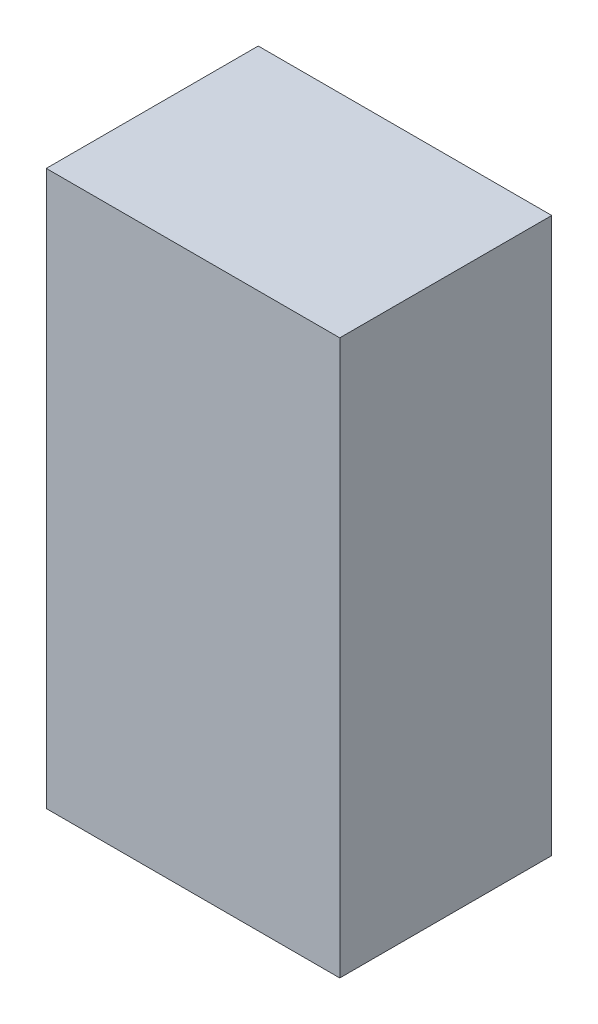
ISO-10303-21;
HEADER;
FILE_DESCRIPTION(('STEP AP214'),'2;1');
FILE_NAME('part.step','',(''),(''),'','','');
FILE_SCHEMA(('AUTOMOTIVE_DESIGN { 1 0 10303 214 1 1 1 1 }'));
ENDSEC;
DATA;
#1=APPLICATION_CONTEXT('core data for automotive mechanical design processes');
#2=APPLICATION_PROTOCOL_DEFINITION('international standard','automotive_design',2000,#1);
#3=PRODUCT_CONTEXT('',#1,'mechanical');
#4=PRODUCT('Part','Part','',(#3));
#5=PRODUCT_RELATED_PRODUCT_CATEGORY('part','',(#4));
#6=PRODUCT_DEFINITION_FORMATION('','',#4);
#7=PRODUCT_DEFINITION_CONTEXT('part definition',#1,'design');
#8=PRODUCT_DEFINITION('design','',#6,#7);
#9=PRODUCT_DEFINITION_SHAPE('','',#8);
#10=(LENGTH_UNIT() NAMED_UNIT(*) SI_UNIT(.MILLI.,.METRE.));
#11=(NAMED_UNIT(*) PLANE_ANGLE_UNIT() SI_UNIT($,.RADIAN.));
#12=(NAMED_UNIT(*) SI_UNIT($,.STERADIAN.) SOLID_ANGLE_UNIT());
#13=UNCERTAINTY_MEASURE_WITH_UNIT(LENGTH_MEASURE(1.E-05),#10,'distance_accuracy_value','');
#14=(GEOMETRIC_REPRESENTATION_CONTEXT(3) GLOBAL_UNCERTAINTY_ASSIGNED_CONTEXT((#13)) GLOBAL_UNIT_ASSIGNED_CONTEXT((#10,
#11,#12)) REPRESENTATION_CONTEXT('',''));
#15=CARTESIAN_POINT('',(0.,0.,0.));
#16=DIRECTION('',(0.,0.,1.));
#17=DIRECTION('',(1.,0.,0.));
#18=AXIS2_PLACEMENT_3D('',#15,#16,#17);
#19=CARTESIAN_POINT('',(-0.90000074,1.69999914,1.29999994));
#20=DIRECTION('',(0.,0.,-1.));
#21=DIRECTION('',(-1.,0.,0.));
#22=AXIS2_PLACEMENT_3D('',#19,#20,#21);
#23=PLANE('',#22);
#24=DIRECTION('',(1.,0.,0.));
#25=VECTOR('',#24,1.);
#26=CARTESIAN_POINT('',(-0.90000074,-1.69999914,1.29999994));
#27=LINE('',#26,#25);
#28=CARTESIAN_POINT('',(-0.90000074,-1.69999914,1.29999994));
#29=VERTEX_POINT('',#28);
#30=CARTESIAN_POINT('',(0.90000074,-1.69999914,1.29999994));
#31=VERTEX_POINT('',#30);
#32=EDGE_CURVE('E54',#29,#31,#27,.T.);
#33=ORIENTED_EDGE('',*,*,#32,.T.);
#34=DIRECTION('',(0.,1.,0.));
#35=VECTOR('',#34,1.);
#36=CARTESIAN_POINT('',(0.90000074,-1.69999914,1.29999994));
#37=LINE('',#36,#35);
#38=CARTESIAN_POINT('',(0.90000074,1.69999914,1.29999994));
#39=VERTEX_POINT('',#38);
#40=EDGE_CURVE('E56',#31,#39,#37,.T.);
#41=ORIENTED_EDGE('',*,*,#40,.T.);
#42=DIRECTION('',(1.,0.,0.));
#43=VECTOR('',#42,1.);
#44=CARTESIAN_POINT('',(0.90000074,1.69999914,1.29999994));
#45=LINE('',#44,#43);
#46=CARTESIAN_POINT('',(-0.90000074,1.69999914,1.29999994));
#47=VERTEX_POINT('',#46);
#48=EDGE_CURVE('E19',#39,#47,#45,.F.);
#49=ORIENTED_EDGE('',*,*,#48,.T.);
#50=DIRECTION('',(0.,1.,0.));
#51=VECTOR('',#50,1.);
#52=CARTESIAN_POINT('',(-0.90000074,1.69999914,1.29999994));
#53=LINE('',#52,#51);
#54=EDGE_CURVE('E79',#47,#29,#53,.F.);
#55=ORIENTED_EDGE('',*,*,#54,.T.);
#56=EDGE_LOOP('',(#33,#41,#49,#55));
#57=FACE_BOUND('',#56,.T.);
#58=ADVANCED_FACE('F16',(#57),#23,.F.);
#59=CARTESIAN_POINT('',(0.90000074,1.69999914,0.));
#60=DIRECTION('',(0.,-1.,0.));
#61=DIRECTION('',(0.,0.,-1.));
#62=AXIS2_PLACEMENT_3D('',#59,#60,#61);
#63=PLANE('',#62);
#64=DIRECTION('',(0.,0.,-1.));
#65=VECTOR('',#64,1.);
#66=CARTESIAN_POINT('',(-0.90000074,1.69999914,0.));
#67=LINE('',#66,#65);
#68=CARTESIAN_POINT('',(-0.90000074,1.69999914,0.));
#69=VERTEX_POINT('',#68);
#70=EDGE_CURVE('E67',#69,#47,#67,.F.);
#71=ORIENTED_EDGE('',*,*,#70,.T.);
#72=ORIENTED_EDGE('',*,*,#48,.F.);
#73=DIRECTION('',(0.,0.,1.));
#74=VECTOR('',#73,1.);
#75=CARTESIAN_POINT('',(0.90000074,1.69999914,0.));
#76=LINE('',#75,#74);
#77=CARTESIAN_POINT('',(0.90000074,1.69999914,0.));
#78=VERTEX_POINT('',#77);
#79=EDGE_CURVE('E62',#39,#78,#76,.F.);
#80=ORIENTED_EDGE('',*,*,#79,.T.);
#81=DIRECTION('',(-1.,0.,0.));
#82=VECTOR('',#81,1.);
#83=CARTESIAN_POINT('',(-0.90000074,1.69999914,0.));
#84=LINE('',#83,#82);
#85=EDGE_CURVE('E82',#69,#78,#84,.F.);
#86=ORIENTED_EDGE('',*,*,#85,.F.);
#87=EDGE_LOOP('',(#71,#72,#80,#86));
#88=FACE_BOUND('',#87,.T.);
#89=ADVANCED_FACE('F64',(#88),#63,.F.);
#90=CARTESIAN_POINT('',(0.90000074,-1.69999914,0.));
#91=DIRECTION('',(-1.,0.,0.));
#92=DIRECTION('',(0.,0.,1.));
#93=AXIS2_PLACEMENT_3D('',#90,#91,#92);
#94=PLANE('',#93);
#95=ORIENTED_EDGE('',*,*,#79,.F.);
#96=ORIENTED_EDGE('',*,*,#40,.F.);
#97=DIRECTION('',(0.,0.,1.));
#98=VECTOR('',#97,1.);
#99=CARTESIAN_POINT('',(0.90000074,-1.69999914,0.));
#100=LINE('',#99,#98);
#101=CARTESIAN_POINT('',(0.90000074,-1.69999914,0.));
#102=VERTEX_POINT('',#101);
#103=EDGE_CURVE('E74',#31,#102,#100,.F.);
#104=ORIENTED_EDGE('',*,*,#103,.T.);
#105=DIRECTION('',(0.,1.,0.));
#106=VECTOR('',#105,1.);
#107=CARTESIAN_POINT('',(0.90000074,1.69999914,0.));
#108=LINE('',#107,#106);
#109=EDGE_CURVE('E71',#78,#102,#108,.F.);
#110=ORIENTED_EDGE('',*,*,#109,.F.);
#111=EDGE_LOOP('',(#95,#96,#104,#110));
#112=FACE_BOUND('',#111,.T.);
#113=ADVANCED_FACE('F69',(#112),#94,.F.);
#114=CARTESIAN_POINT('',(-0.90000074,-1.69999914,0.));
#115=DIRECTION('',(0.,1.,0.));
#116=DIRECTION('',(0.,0.,1.));
#117=AXIS2_PLACEMENT_3D('',#114,#115,#116);
#118=PLANE('',#117);
#119=ORIENTED_EDGE('',*,*,#103,.F.);
#120=ORIENTED_EDGE('',*,*,#32,.F.);
#121=DIRECTION('',(0.,0.,-1.));
#122=VECTOR('',#121,1.);
#123=CARTESIAN_POINT('',(-0.90000074,-1.69999914,0.));
#124=LINE('',#123,#122);
#125=CARTESIAN_POINT('',(-0.90000074,-1.69999914,0.));
#126=VERTEX_POINT('',#125);
#127=EDGE_CURVE('E34',#29,#126,#124,.T.);
#128=ORIENTED_EDGE('',*,*,#127,.T.);
#129=DIRECTION('',(-1.,0.,0.));
#130=VECTOR('',#129,1.);
#131=CARTESIAN_POINT('',(-0.90000074,-1.69999914,0.));
#132=LINE('',#131,#130);
#133=EDGE_CURVE('E25',#102,#126,#132,.T.);
#134=ORIENTED_EDGE('',*,*,#133,.F.);
#135=EDGE_LOOP('',(#119,#120,#128,#134));
#136=FACE_BOUND('',#135,.T.);
#137=ADVANCED_FACE('F88',(#136),#118,.F.);
#138=CARTESIAN_POINT('',(-0.90000074,1.69999914,0.));
#139=DIRECTION('',(1.,0.,0.));
#140=DIRECTION('',(0.,0.,-1.));
#141=AXIS2_PLACEMENT_3D('',#138,#139,#140);
#142=PLANE('',#141);
#143=ORIENTED_EDGE('',*,*,#127,.F.);
#144=ORIENTED_EDGE('',*,*,#54,.F.);
#145=ORIENTED_EDGE('',*,*,#70,.F.);
#146=DIRECTION('',(0.,1.,0.));
#147=VECTOR('',#146,1.);
#148=CARTESIAN_POINT('',(-0.90000074,1.69999914,0.));
#149=LINE('',#148,#147);
#150=EDGE_CURVE('E11',#126,#69,#149,.T.);
#151=ORIENTED_EDGE('',*,*,#150,.F.);
#152=EDGE_LOOP('',(#143,#144,#145,#151));
#153=FACE_BOUND('',#152,.T.);
#154=ADVANCED_FACE('F90',(#153),#142,.F.);
#155=CARTESIAN_POINT('',(-0.90000074,1.69999914,0.));
#156=DIRECTION('',(0.,0.,-1.));
#157=DIRECTION('',(-1.,0.,0.));
#158=AXIS2_PLACEMENT_3D('',#155,#156,#157);
#159=PLANE('',#158);
#160=ORIENTED_EDGE('',*,*,#133,.T.);
#161=ORIENTED_EDGE('',*,*,#150,.T.);
#162=ORIENTED_EDGE('',*,*,#85,.T.);
#163=ORIENTED_EDGE('',*,*,#109,.T.);
#164=EDGE_LOOP('',(#160,#161,#162,#163));
#165=FACE_BOUND('',#164,.T.);
#166=ADVANCED_FACE('F87',(#165),#159,.T.);
#167=CLOSED_SHELL('',(#58,#89,#113,#137,#154,#166));
#168=MANIFOLD_SOLID_BREP('B1',#167);
#169=ADVANCED_BREP_SHAPE_REPRESENTATION('',(#18,#168),#14);
#170=SHAPE_DEFINITION_REPRESENTATION(#9,#169);
ENDSEC;
END-ISO-10303-21;
